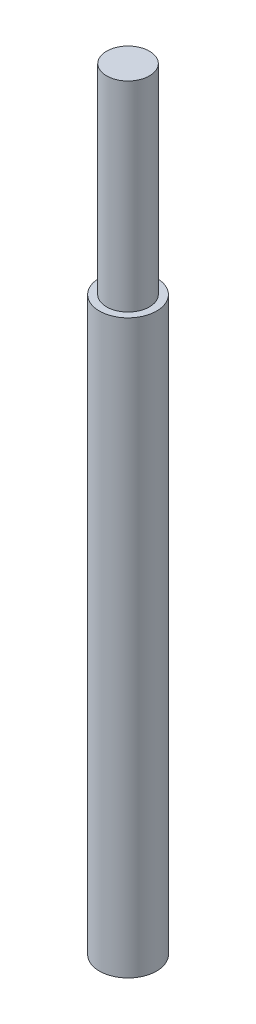
ISO-10303-21;
HEADER;
FILE_DESCRIPTION(('STEP AP214'),'2;1');
FILE_NAME('part.step','',(''),(''),'','','');
FILE_SCHEMA(('AUTOMOTIVE_DESIGN { 1 0 10303 214 1 1 1 1 }'));
ENDSEC;
DATA;
#1=APPLICATION_CONTEXT('core data for automotive mechanical design processes');
#2=APPLICATION_PROTOCOL_DEFINITION('international standard','automotive_design',2000,#1);
#3=PRODUCT_CONTEXT('',#1,'mechanical');
#4=PRODUCT('Part','Part','',(#3));
#5=PRODUCT_RELATED_PRODUCT_CATEGORY('part','',(#4));
#6=PRODUCT_DEFINITION_FORMATION('','',#4);
#7=PRODUCT_DEFINITION_CONTEXT('part definition',#1,'design');
#8=PRODUCT_DEFINITION('design','',#6,#7);
#9=PRODUCT_DEFINITION_SHAPE('','',#8);
#10=(LENGTH_UNIT() NAMED_UNIT(*) SI_UNIT(.MILLI.,.METRE.));
#11=(NAMED_UNIT(*) PLANE_ANGLE_UNIT() SI_UNIT($,.RADIAN.));
#12=(NAMED_UNIT(*) SI_UNIT($,.STERADIAN.) SOLID_ANGLE_UNIT());
#13=UNCERTAINTY_MEASURE_WITH_UNIT(LENGTH_MEASURE(1.E-05),#10,'distance_accuracy_value','');
#14=(GEOMETRIC_REPRESENTATION_CONTEXT(3) GLOBAL_UNCERTAINTY_ASSIGNED_CONTEXT((#13)) GLOBAL_UNIT_ASSIGNED_CONTEXT((#10,
#11,#12)) REPRESENTATION_CONTEXT('',''));
#15=CARTESIAN_POINT('',(0.,0.,0.));
#16=DIRECTION('',(0.,0.,1.));
#17=DIRECTION('',(1.,0.,0.));
#18=AXIS2_PLACEMENT_3D('',#15,#16,#17);
#19=CARTESIAN_POINT('',(0.,70.,0.));
#20=DIRECTION('',(0.,-1.,0.));
#21=DIRECTION('',(0.,0.,-1.));
#22=AXIS2_PLACEMENT_3D('',#19,#20,#21);
#23=CYLINDRICAL_SURFACE('',#22,7.5);
#24=CARTESIAN_POINT('',(0.,70.,0.));
#25=DIRECTION('',(0.,1.,0.));
#26=DIRECTION('',(0.,0.,1.));
#27=AXIS2_PLACEMENT_3D('',#24,#25,#26);
#28=CIRCLE('',#27,7.5);
#29=CARTESIAN_POINT('',(0.,70.,7.5));
#30=VERTEX_POINT('',#29);
#31=EDGE_CURVE('E10',#30,#30,#28,.T.);
#32=ORIENTED_EDGE('',*,*,#31,.F.);
#33=EDGE_LOOP('',(#32));
#34=FACE_BOUND('',#33,.T.);
#35=CARTESIAN_POINT('',(0.,0.,0.));
#36=DIRECTION('',(0.,1.,0.));
#37=DIRECTION('',(0.,0.,1.));
#38=AXIS2_PLACEMENT_3D('',#35,#36,#37);
#39=CIRCLE('',#38,7.5);
#40=CARTESIAN_POINT('',(0.,0.,7.5));
#41=VERTEX_POINT('',#40);
#42=EDGE_CURVE('E35',#41,#41,#39,.T.);
#43=ORIENTED_EDGE('',*,*,#42,.T.);
#44=EDGE_LOOP('',(#43));
#45=FACE_BOUND('',#44,.T.);
#46=ADVANCED_FACE('F32',(#34,#45),#23,.T.);
#47=CARTESIAN_POINT('',(0.,70.,0.));
#48=DIRECTION('',(0.,1.,0.));
#49=DIRECTION('',(0.,0.,1.));
#50=AXIS2_PLACEMENT_3D('',#47,#48,#49);
#51=PLANE('',#50);
#52=ORIENTED_EDGE('',*,*,#31,.T.);
#53=EDGE_LOOP('',(#52));
#54=FACE_BOUND('',#53,.T.);
#55=ADVANCED_FACE('F55',(#54),#51,.T.);
#56=CARTESIAN_POINT('',(0.,-200.,0.));
#57=DIRECTION('',(0.,1.,0.));
#58=DIRECTION('',(0.,0.,1.));
#59=AXIS2_PLACEMENT_3D('',#56,#57,#58);
#60=CYLINDRICAL_SURFACE('',#59,10.);
#61=CARTESIAN_POINT('',(0.,-200.,0.));
#62=DIRECTION('',(0.,-1.,0.));
#63=DIRECTION('',(0.,0.,-1.));
#64=AXIS2_PLACEMENT_3D('',#61,#62,#63);
#65=CIRCLE('',#64,10.);
#66=CARTESIAN_POINT('',(0.,-200.,-10.));
#67=VERTEX_POINT('',#66);
#68=EDGE_CURVE('E42',#67,#67,#65,.T.);
#69=ORIENTED_EDGE('',*,*,#68,.F.);
#70=EDGE_LOOP('',(#69));
#71=FACE_BOUND('',#70,.T.);
#72=CARTESIAN_POINT('',(0.,0.,0.));
#73=DIRECTION('',(0.,-1.,0.));
#74=DIRECTION('',(0.,0.,-1.));
#75=AXIS2_PLACEMENT_3D('',#72,#73,#74);
#76=CIRCLE('',#75,10.);
#77=CARTESIAN_POINT('',(0.,0.,-10.));
#78=VERTEX_POINT('',#77);
#79=EDGE_CURVE('E44',#78,#78,#76,.T.);
#80=ORIENTED_EDGE('',*,*,#79,.T.);
#81=EDGE_LOOP('',(#80));
#82=FACE_BOUND('',#81,.T.);
#83=ADVANCED_FACE('F52',(#71,#82),#60,.T.);
#84=CARTESIAN_POINT('',(0.,-200.,0.));
#85=DIRECTION('',(0.,-1.,0.));
#86=DIRECTION('',(0.,0.,-1.));
#87=AXIS2_PLACEMENT_3D('',#84,#85,#86);
#88=PLANE('',#87);
#89=ORIENTED_EDGE('',*,*,#68,.T.);
#90=EDGE_LOOP('',(#89));
#91=FACE_BOUND('',#90,.T.);
#92=ADVANCED_FACE('F50',(#91),#88,.T.);
#93=CARTESIAN_POINT('',(0.,0.,0.));
#94=DIRECTION('',(0.,-1.,0.));
#95=DIRECTION('',(0.,0.,-1.));
#96=AXIS2_PLACEMENT_3D('',#93,#94,#95);
#97=PLANE('',#96);
#98=ORIENTED_EDGE('',*,*,#42,.F.);
#99=EDGE_LOOP('',(#98));
#100=FACE_BOUND('',#99,.T.);
#101=ORIENTED_EDGE('',*,*,#79,.F.);
#102=EDGE_LOOP('',(#101));
#103=FACE_BOUND('',#102,.T.);
#104=ADVANCED_FACE('F59',(#100,#103),#97,.F.);
#105=CLOSED_SHELL('',(#46,#55,#83,#92,#104));
#106=MANIFOLD_SOLID_BREP('B2',#105);
#107=ADVANCED_BREP_SHAPE_REPRESENTATION('',(#18,#106),#14);
#108=SHAPE_DEFINITION_REPRESENTATION(#9,#107);
ENDSEC;
END-ISO-10303-21;
